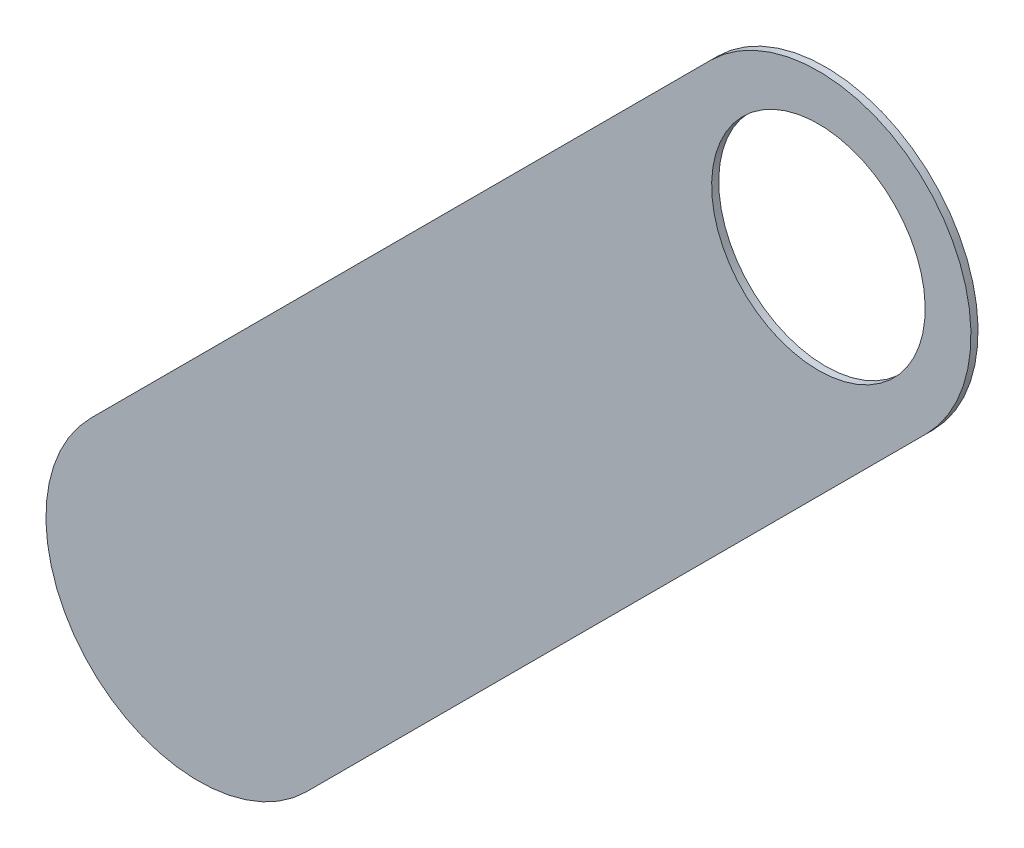
ISO-10303-21;
HEADER;
FILE_DESCRIPTION(('STEP AP214'),'2;1');
FILE_NAME('part.step','',(''),(''),'','','');
FILE_SCHEMA(('AUTOMOTIVE_DESIGN { 1 0 10303 214 1 1 1 1 }'));
ENDSEC;
DATA;
#1=APPLICATION_CONTEXT('core data for automotive mechanical design processes');
#2=APPLICATION_PROTOCOL_DEFINITION('international standard','automotive_design',2000,#1);
#3=PRODUCT_CONTEXT('',#1,'mechanical');
#4=PRODUCT('Part','Part','',(#3));
#5=PRODUCT_RELATED_PRODUCT_CATEGORY('part','',(#4));
#6=PRODUCT_DEFINITION_FORMATION('','',#4);
#7=PRODUCT_DEFINITION_CONTEXT('part definition',#1,'design');
#8=PRODUCT_DEFINITION('design','',#6,#7);
#9=PRODUCT_DEFINITION_SHAPE('','',#8);
#10=(LENGTH_UNIT() NAMED_UNIT(*) SI_UNIT(.MILLI.,.METRE.));
#11=(NAMED_UNIT(*) PLANE_ANGLE_UNIT() SI_UNIT($,.RADIAN.));
#12=(NAMED_UNIT(*) SI_UNIT($,.STERADIAN.) SOLID_ANGLE_UNIT());
#13=UNCERTAINTY_MEASURE_WITH_UNIT(LENGTH_MEASURE(1.E-05),#10,'distance_accuracy_value','');
#14=(GEOMETRIC_REPRESENTATION_CONTEXT(3) GLOBAL_UNCERTAINTY_ASSIGNED_CONTEXT((#13)) GLOBAL_UNIT_ASSIGNED_CONTEXT((#10,
#11,#12)) REPRESENTATION_CONTEXT('',''));
#15=CARTESIAN_POINT('',(0.,0.,0.));
#16=DIRECTION('',(0.,0.,1.));
#17=DIRECTION('',(1.,0.,0.));
#18=AXIS2_PLACEMENT_3D('',#15,#16,#17);
#19=CARTESIAN_POINT('',(123.952,-125.984,-0.045));
#20=DIRECTION('',(0.,0.,-1.));
#21=DIRECTION('',(0.,-1.,0.));
#22=AXIS2_PLACEMENT_3D('',#19,#20,#21);
#23=CYLINDRICAL_SURFACE('',#22,0.525);
#24=CARTESIAN_POINT('',(123.952,-125.984,-0.035));
#25=DIRECTION('',(0.,0.,-1.));
#26=DIRECTION('',(0.,-1.,0.));
#27=AXIS2_PLACEMENT_3D('',#24,#25,#26);
#28=CIRCLE('',#27,0.525);
#29=CARTESIAN_POINT('',(123.952,-126.509,-0.035));
#30=VERTEX_POINT('',#29);
#31=EDGE_CURVE('E130',#30,#30,#28,.T.);
#32=ORIENTED_EDGE('',*,*,#31,.T.);
#33=DIRECTION('',(0.,0.,1.));
#34=VECTOR('',#33,1.);
#35=CARTESIAN_POINT('',(123.952,-126.509,-0.045));
#36=LINE('',#35,#34);
#37=CARTESIAN_POINT('',(123.952,-126.509,0.));
#38=VERTEX_POINT('',#37);
#39=EDGE_CURVE('E11',#30,#38,#36,.T.);
#40=ORIENTED_EDGE('',*,*,#39,.T.);
#41=CARTESIAN_POINT('',(123.952,-125.984,0.));
#42=DIRECTION('',(0.,0.,-1.));
#43=DIRECTION('',(0.,-1.,0.));
#44=AXIS2_PLACEMENT_3D('',#41,#42,#43);
#45=CIRCLE('',#44,0.525);
#46=EDGE_CURVE('E26',#38,#38,#45,.T.);
#47=ORIENTED_EDGE('',*,*,#46,.F.);
#48=ORIENTED_EDGE('',*,*,#39,.F.);
#49=EDGE_LOOP('',(#32,#40,#47,#48));
#50=FACE_BOUND('',#49,.T.);
#51=ADVANCED_FACE('F17',(#50),#23,.F.);
#52=CARTESIAN_POINT('',(121.43433,-129.56233,-0.035));
#53=DIRECTION('',(-0.707106781186548,0.707106781186548,0.));
#54=DIRECTION('',(0.,0.,1.));
#55=AXIS2_PLACEMENT_3D('',#52,#53,#54);
#56=PLANE('',#55);
#57=DIRECTION('',(0.707106781186548,0.707106781186548,0.));
#58=VECTOR('',#57,1.);
#59=CARTESIAN_POINT('',(121.43433,-129.56233,-0.035));
#60=LINE('',#59,#58);
#61=CARTESIAN_POINT('',(121.43433,-129.56233,-0.035));
#62=VERTEX_POINT('',#61);
#63=CARTESIAN_POINT('',(124.48233,-126.51433,-0.035));
#64=VERTEX_POINT('',#63);
#65=EDGE_CURVE('E125',#62,#64,#60,.T.);
#66=ORIENTED_EDGE('',*,*,#65,.T.);
#67=DIRECTION('',(0.,0.,1.));
#68=VECTOR('',#67,1.);
#69=CARTESIAN_POINT('',(124.48233,-126.51433,-0.035));
#70=LINE('',#69,#68);
#71=CARTESIAN_POINT('',(124.48233,-126.51433,0.));
#72=VERTEX_POINT('',#71);
#73=EDGE_CURVE('E84',#64,#72,#70,.T.);
#74=ORIENTED_EDGE('',*,*,#73,.T.);
#75=DIRECTION('',(0.707106781186548,0.707106781186548,0.));
#76=VECTOR('',#75,1.);
#77=CARTESIAN_POINT('',(121.43433,-129.56233,0.));
#78=LINE('',#77,#76);
#79=CARTESIAN_POINT('',(121.43433,-129.56233,0.));
#80=VERTEX_POINT('',#79);
#81=EDGE_CURVE('E115',#80,#72,#78,.T.);
#82=ORIENTED_EDGE('',*,*,#81,.F.);
#83=DIRECTION('',(0.,0.,1.));
#84=VECTOR('',#83,1.);
#85=CARTESIAN_POINT('',(121.43433,-129.56233,-0.035));
#86=LINE('',#85,#84);
#87=EDGE_CURVE('E117',#62,#80,#86,.T.);
#88=ORIENTED_EDGE('',*,*,#87,.F.);
#89=EDGE_LOOP('',(#66,#74,#82,#88));
#90=FACE_BOUND('',#89,.T.);
#91=ADVANCED_FACE('F19',(#90),#56,.F.);
#92=CARTESIAN_POINT('',(123.421669,-125.453669,0.));
#93=DIRECTION('',(0.,0.,1.));
#94=DIRECTION('',(1.,0.,0.));
#95=AXIS2_PLACEMENT_3D('',#92,#93,#94);
#96=PLANE('',#95);
#97=ORIENTED_EDGE('',*,*,#46,.T.);
#98=EDGE_LOOP('',(#97));
#99=FACE_BOUND('',#98,.T.);
#100=DIRECTION('',(-0.707106781186548,-0.707106781186548,0.));
#101=VECTOR('',#100,1.);
#102=CARTESIAN_POINT('',(123.421669,-125.453669,0.));
#103=LINE('',#102,#101);
#104=CARTESIAN_POINT('',(123.421669,-125.453669,0.));
#105=VERTEX_POINT('',#104);
#106=CARTESIAN_POINT('',(120.373669,-128.501669,0.));
#107=VERTEX_POINT('',#106);
#108=EDGE_CURVE('E96',#105,#107,#103,.T.);
#109=ORIENTED_EDGE('',*,*,#108,.T.);
#110=CARTESIAN_POINT('',(120.9039995,-129.0319995,0.));
#111=DIRECTION('',(0.,0.,1.));
#112=DIRECTION('',(-0.707106781186548,0.707106781186548,0.));
#113=AXIS2_PLACEMENT_3D('',#110,#111,#112);
#114=CIRCLE('',#113,0.75000058564);
#115=EDGE_CURVE('E121',#107,#80,#114,.T.);
#116=ORIENTED_EDGE('',*,*,#115,.T.);
#117=ORIENTED_EDGE('',*,*,#81,.T.);
#118=CARTESIAN_POINT('',(123.9519995,-125.9839995,0.));
#119=DIRECTION('',(0.,0.,1.));
#120=DIRECTION('',(0.707106781186548,-0.707106781186548,0.));
#121=AXIS2_PLACEMENT_3D('',#118,#119,#120);
#122=CIRCLE('',#121,0.75000058564);
#123=EDGE_CURVE('E88',#72,#105,#122,.T.);
#124=ORIENTED_EDGE('',*,*,#123,.T.);
#125=EDGE_LOOP('',(#109,#116,#117,#124));
#126=FACE_BOUND('',#125,.T.);
#127=ADVANCED_FACE('F142',(#99,#126),#96,.T.);
#128=CARTESIAN_POINT('',(123.421669,-125.453669,-0.035));
#129=DIRECTION('',(0.,0.,1.));
#130=DIRECTION('',(1.,0.,0.));
#131=AXIS2_PLACEMENT_3D('',#128,#129,#130);
#132=PLANE('',#131);
#133=ORIENTED_EDGE('',*,*,#31,.F.);
#134=EDGE_LOOP('',(#133));
#135=FACE_BOUND('',#134,.T.);
#136=CARTESIAN_POINT('',(123.9519995,-125.9839995,-0.035));
#137=DIRECTION('',(0.,0.,1.));
#138=DIRECTION('',(0.707106781186548,-0.707106781186548,0.));
#139=AXIS2_PLACEMENT_3D('',#136,#137,#138);
#140=CIRCLE('',#139,0.75000058564);
#141=CARTESIAN_POINT('',(123.421669,-125.453669,-0.035));
#142=VERTEX_POINT('',#141);
#143=EDGE_CURVE('E77',#64,#142,#140,.T.);
#144=ORIENTED_EDGE('',*,*,#143,.F.);
#145=ORIENTED_EDGE('',*,*,#65,.F.);
#146=CARTESIAN_POINT('',(120.9039995,-129.0319995,-0.035));
#147=DIRECTION('',(0.,0.,1.));
#148=DIRECTION('',(-0.707106781186548,0.707106781186548,0.));
#149=AXIS2_PLACEMENT_3D('',#146,#147,#148);
#150=CIRCLE('',#149,0.75000058564);
#151=CARTESIAN_POINT('',(120.373669,-128.501669,-0.035));
#152=VERTEX_POINT('',#151);
#153=EDGE_CURVE('E101',#152,#62,#150,.T.);
#154=ORIENTED_EDGE('',*,*,#153,.F.);
#155=DIRECTION('',(-0.707106781186548,-0.707106781186548,0.));
#156=VECTOR('',#155,1.);
#157=CARTESIAN_POINT('',(123.421669,-125.453669,-0.035));
#158=LINE('',#157,#156);
#159=EDGE_CURVE('E94',#142,#152,#158,.T.);
#160=ORIENTED_EDGE('',*,*,#159,.F.);
#161=EDGE_LOOP('',(#144,#145,#154,#160));
#162=FACE_BOUND('',#161,.T.);
#163=ADVANCED_FACE('F99',(#135,#162),#132,.F.);
#164=CARTESIAN_POINT('',(120.9039995,-129.0319995,-0.035));
#165=DIRECTION('',(0.,0.,-1.));
#166=DIRECTION('',(-0.707106781186548,0.707106781186548,0.));
#167=AXIS2_PLACEMENT_3D('',#164,#165,#166);
#168=CYLINDRICAL_SURFACE('',#167,0.75000058564);
#169=ORIENTED_EDGE('',*,*,#153,.T.);
#170=ORIENTED_EDGE('',*,*,#87,.T.);
#171=ORIENTED_EDGE('',*,*,#115,.F.);
#172=DIRECTION('',(0.,0.,1.));
#173=VECTOR('',#172,1.);
#174=CARTESIAN_POINT('',(120.373669,-128.501669,-0.035));
#175=LINE('',#174,#173);
#176=EDGE_CURVE('E104',#152,#107,#175,.T.);
#177=ORIENTED_EDGE('',*,*,#176,.F.);
#178=EDGE_LOOP('',(#169,#170,#171,#177));
#179=FACE_BOUND('',#178,.T.);
#180=ADVANCED_FACE('F141',(#179),#168,.T.);
#181=CARTESIAN_POINT('',(123.9519995,-125.9839995,-0.035));
#182=DIRECTION('',(0.,0.,-1.));
#183=DIRECTION('',(0.707106781186548,-0.707106781186548,0.));
#184=AXIS2_PLACEMENT_3D('',#181,#182,#183);
#185=CYLINDRICAL_SURFACE('',#184,0.75000058564);
#186=ORIENTED_EDGE('',*,*,#143,.T.);
#187=DIRECTION('',(0.,0.,1.));
#188=VECTOR('',#187,1.);
#189=CARTESIAN_POINT('',(123.421669,-125.453669,-0.035));
#190=LINE('',#189,#188);
#191=EDGE_CURVE('E81',#142,#105,#190,.T.);
#192=ORIENTED_EDGE('',*,*,#191,.T.);
#193=ORIENTED_EDGE('',*,*,#123,.F.);
#194=ORIENTED_EDGE('',*,*,#73,.F.);
#195=EDGE_LOOP('',(#186,#192,#193,#194));
#196=FACE_BOUND('',#195,.T.);
#197=ADVANCED_FACE('F79',(#196),#185,.T.);
#198=CARTESIAN_POINT('',(123.421669,-125.453669,-0.035));
#199=DIRECTION('',(0.707106781186548,-0.707106781186548,0.));
#200=DIRECTION('',(0.,0.,-1.));
#201=AXIS2_PLACEMENT_3D('',#198,#199,#200);
#202=PLANE('',#201);
#203=ORIENTED_EDGE('',*,*,#159,.T.);
#204=ORIENTED_EDGE('',*,*,#176,.T.);
#205=ORIENTED_EDGE('',*,*,#108,.F.);
#206=ORIENTED_EDGE('',*,*,#191,.F.);
#207=EDGE_LOOP('',(#203,#204,#205,#206));
#208=FACE_BOUND('',#207,.T.);
#209=ADVANCED_FACE('F92',(#208),#202,.F.);
#210=CLOSED_SHELL('',(#51,#91,#127,#163,#180,#197,#209));
#211=MANIFOLD_SOLID_BREP('B1',#210);
#212=ADVANCED_BREP_SHAPE_REPRESENTATION('',(#18,#211),#14);
#213=SHAPE_DEFINITION_REPRESENTATION(#9,#212);
ENDSEC;
END-ISO-10303-21;
